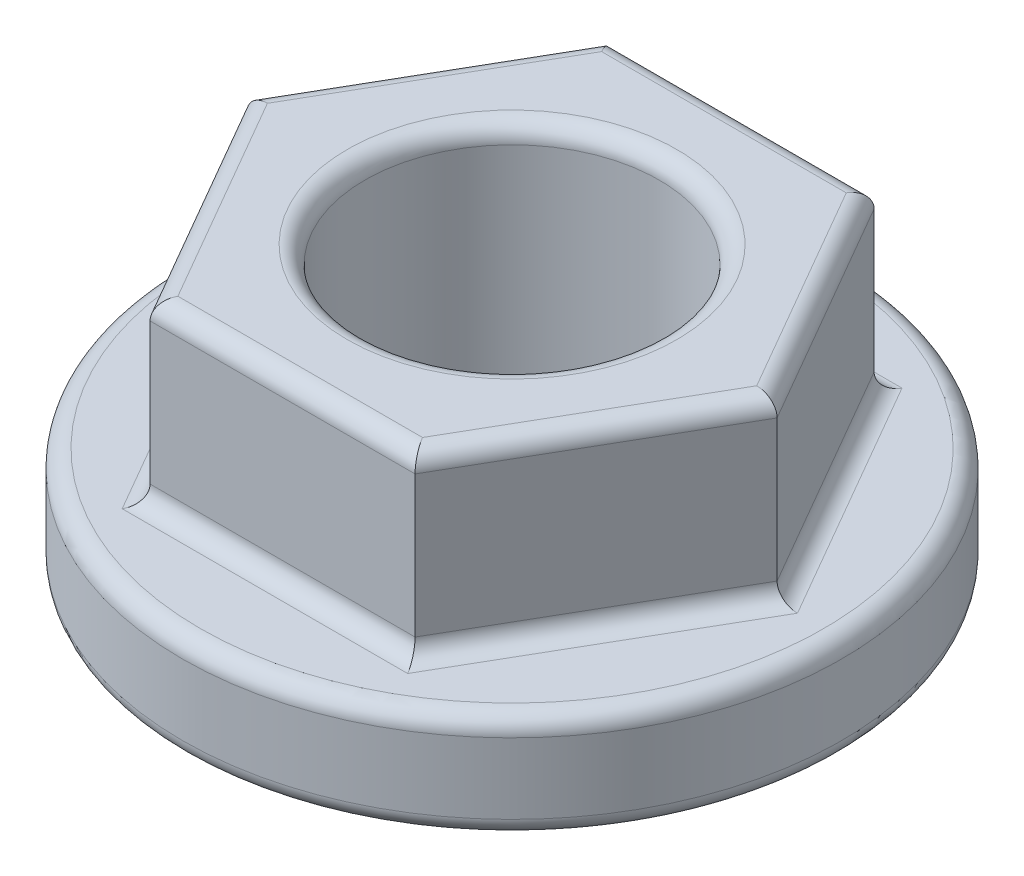
ISO-10303-21;
HEADER;
FILE_DESCRIPTION(('STEP AP214'),'2;1');
FILE_NAME('part.step','',(''),(''),'','','');
FILE_SCHEMA(('AUTOMOTIVE_DESIGN { 1 0 10303 214 1 1 1 1 }'));
ENDSEC;
DATA;
#1=APPLICATION_CONTEXT('core data for automotive mechanical design processes');
#2=APPLICATION_PROTOCOL_DEFINITION('international standard','automotive_design',2000,#1);
#3=PRODUCT_CONTEXT('',#1,'mechanical');
#4=PRODUCT('Part','Part','',(#3));
#5=PRODUCT_RELATED_PRODUCT_CATEGORY('part','',(#4));
#6=PRODUCT_DEFINITION_FORMATION('','',#4);
#7=PRODUCT_DEFINITION_CONTEXT('part definition',#1,'design');
#8=PRODUCT_DEFINITION('design','',#6,#7);
#9=PRODUCT_DEFINITION_SHAPE('','',#8);
#10=(LENGTH_UNIT() NAMED_UNIT(*) SI_UNIT(.MILLI.,.METRE.));
#11=(NAMED_UNIT(*) PLANE_ANGLE_UNIT() SI_UNIT($,.RADIAN.));
#12=(NAMED_UNIT(*) SI_UNIT($,.STERADIAN.) SOLID_ANGLE_UNIT());
#13=UNCERTAINTY_MEASURE_WITH_UNIT(LENGTH_MEASURE(1.E-05),#10,'distance_accuracy_value','');
#14=(GEOMETRIC_REPRESENTATION_CONTEXT(3) GLOBAL_UNCERTAINTY_ASSIGNED_CONTEXT((#13)) GLOBAL_UNIT_ASSIGNED_CONTEXT((#10,
#11,#12)) REPRESENTATION_CONTEXT('',''));
#15=CARTESIAN_POINT('',(0.,0.,0.));
#16=DIRECTION('',(0.,0.,1.));
#17=DIRECTION('',(1.,0.,0.));
#18=AXIS2_PLACEMENT_3D('',#15,#16,#17);
#19=CARTESIAN_POINT('',(0.,4.8,0.));
#20=DIRECTION('',(0.,-1.,0.));
#21=DIRECTION('',(0.,0.,-1.));
#22=AXIS2_PLACEMENT_3D('',#19,#20,#21);
#23=CYLINDRICAL_SURFACE('',#22,5.6);
#24=CARTESIAN_POINT('',(0.,0.3,0.));
#25=DIRECTION('',(0.,1.,0.));
#26=DIRECTION('',(0.,0.,1.));
#27=AXIS2_PLACEMENT_3D('',#24,#25,#26);
#28=CIRCLE('',#27,5.6);
#29=CARTESIAN_POINT('',(0.,0.3,5.6));
#30=VERTEX_POINT('',#29);
#31=EDGE_CURVE('E246',#30,#30,#28,.T.);
#32=ORIENTED_EDGE('',*,*,#31,.T.);
#33=EDGE_LOOP('',(#32));
#34=FACE_BOUND('',#33,.T.);
#35=CARTESIAN_POINT('',(0.,1.5,0.));
#36=DIRECTION('',(0.,1.,0.));
#37=DIRECTION('',(0.,0.,1.));
#38=AXIS2_PLACEMENT_3D('',#35,#36,#37);
#39=CIRCLE('',#38,5.6);
#40=CARTESIAN_POINT('',(0.,1.5,5.6));
#41=VERTEX_POINT('',#40);
#42=EDGE_CURVE('E243',#41,#41,#39,.F.);
#43=ORIENTED_EDGE('',*,*,#42,.T.);
#44=EDGE_LOOP('',(#43));
#45=FACE_BOUND('',#44,.T.);
#46=ADVANCED_FACE('F33',(#34,#45),#23,.T.);
#47=CARTESIAN_POINT('',(0.,4.8,0.));
#48=DIRECTION('',(0.,1.,0.));
#49=DIRECTION('',(0.,0.,1.));
#50=AXIS2_PLACEMENT_3D('',#47,#48,#49);
#51=PLANE('',#50);
#52=DIRECTION('',(-0.5,0.,0.866025403784439));
#53=VECTOR('',#52,1.);
#54=CARTESIAN_POINT('',(-3.11769145362398,4.8,-1.8));
#55=LINE('',#54,#53);
#56=CARTESIAN_POINT('',(-2.07846096908265,4.8,-3.6));
#57=VERTEX_POINT('',#56);
#58=CARTESIAN_POINT('',(-4.15692193816531,4.8,0.));
#59=VERTEX_POINT('',#58);
#60=EDGE_CURVE('E42',#57,#59,#55,.T.);
#61=ORIENTED_EDGE('',*,*,#60,.T.);
#62=DIRECTION('',(0.5,0.,0.866025403784439));
#63=VECTOR('',#62,1.);
#64=CARTESIAN_POINT('',(-3.11769145362398,4.8,1.8));
#65=LINE('',#64,#63);
#66=CARTESIAN_POINT('',(-2.07846096908265,4.8,3.6));
#67=VERTEX_POINT('',#66);
#68=EDGE_CURVE('E12',#59,#67,#65,.T.);
#69=ORIENTED_EDGE('',*,*,#68,.T.);
#70=DIRECTION('',(1.,0.,0.));
#71=VECTOR('',#70,1.);
#72=CARTESIAN_POINT('',(0.,4.8,3.6));
#73=LINE('',#72,#71);
#74=CARTESIAN_POINT('',(2.07846096908265,4.8,3.6));
#75=VERTEX_POINT('',#74);
#76=EDGE_CURVE('E184',#67,#75,#73,.T.);
#77=ORIENTED_EDGE('',*,*,#76,.T.);
#78=DIRECTION('',(0.5,0.,-0.866025403784439));
#79=VECTOR('',#78,1.);
#80=CARTESIAN_POINT('',(3.11769145362398,4.8,1.8));
#81=LINE('',#80,#79);
#82=CARTESIAN_POINT('',(4.1569219381653,4.8,0.));
#83=VERTEX_POINT('',#82);
#84=EDGE_CURVE('E186',#75,#83,#81,.T.);
#85=ORIENTED_EDGE('',*,*,#84,.T.);
#86=DIRECTION('',(-0.5,0.,-0.866025403784438));
#87=VECTOR('',#86,1.);
#88=CARTESIAN_POINT('',(3.11769145362398,4.8,-1.8));
#89=LINE('',#88,#87);
#90=CARTESIAN_POINT('',(2.07846096908265,4.8,-3.6));
#91=VERTEX_POINT('',#90);
#92=EDGE_CURVE('E188',#83,#91,#89,.T.);
#93=ORIENTED_EDGE('',*,*,#92,.T.);
#94=DIRECTION('',(-1.,0.,0.));
#95=VECTOR('',#94,1.);
#96=CARTESIAN_POINT('',(0.,4.8,-3.6));
#97=LINE('',#96,#95);
#98=EDGE_CURVE('E53',#91,#57,#97,.T.);
#99=ORIENTED_EDGE('',*,*,#98,.T.);
#100=EDGE_LOOP('',(#61,#69,#77,#85,#93,#99));
#101=FACE_BOUND('',#100,.T.);
#102=CARTESIAN_POINT('',(0.,4.8,0.));
#103=DIRECTION('',(0.,1.,0.));
#104=DIRECTION('',(0.,0.,1.));
#105=AXIS2_PLACEMENT_3D('',#102,#103,#104);
#106=CIRCLE('',#105,2.8);
#107=CARTESIAN_POINT('',(0.,4.8,2.8));
#108=VERTEX_POINT('',#107);
#109=EDGE_CURVE('E181',#108,#108,#106,.F.);
#110=ORIENTED_EDGE('',*,*,#109,.T.);
#111=EDGE_LOOP('',(#110));
#112=FACE_BOUND('',#111,.T.);
#113=ADVANCED_FACE('F321',(#101,#112),#51,.T.);
#114=CARTESIAN_POINT('',(0.,0.,0.));
#115=DIRECTION('',(0.,1.,0.));
#116=DIRECTION('',(0.,0.,1.));
#117=AXIS2_PLACEMENT_3D('',#114,#115,#116);
#118=PLANE('',#117);
#119=CARTESIAN_POINT('',(0.,0.,0.));
#120=DIRECTION('',(0.,1.,0.));
#121=DIRECTION('',(0.,0.,1.));
#122=AXIS2_PLACEMENT_3D('',#119,#120,#121);
#123=CIRCLE('',#122,5.3);
#124=CARTESIAN_POINT('',(0.,0.,5.3));
#125=VERTEX_POINT('',#124);
#126=EDGE_CURVE('E253',#125,#125,#123,.F.);
#127=ORIENTED_EDGE('',*,*,#126,.T.);
#128=EDGE_LOOP('',(#127));
#129=FACE_BOUND('',#128,.T.);
#130=CARTESIAN_POINT('',(0.,0.,0.));
#131=DIRECTION('',(0.,1.,0.));
#132=DIRECTION('',(0.,0.,1.));
#133=AXIS2_PLACEMENT_3D('',#130,#131,#132);
#134=CIRCLE('',#133,2.8);
#135=CARTESIAN_POINT('',(0.,0.,2.8));
#136=VERTEX_POINT('',#135);
#137=EDGE_CURVE('E250',#136,#136,#134,.T.);
#138=ORIENTED_EDGE('',*,*,#137,.T.);
#139=EDGE_LOOP('',(#138));
#140=FACE_BOUND('',#139,.T.);
#141=ADVANCED_FACE('F327',(#129,#140),#118,.F.);
#142=CARTESIAN_POINT('',(0.,0.,0.));
#143=DIRECTION('',(0.,1.,0.));
#144=DIRECTION('',(0.,0.,1.));
#145=AXIS2_PLACEMENT_3D('',#142,#143,#144);
#146=CYLINDRICAL_SURFACE('',#145,2.5);
#147=CARTESIAN_POINT('',(0.,0.3,0.));
#148=DIRECTION('',(0.,1.,0.));
#149=DIRECTION('',(0.,0.,1.));
#150=AXIS2_PLACEMENT_3D('',#147,#148,#149);
#151=CIRCLE('',#150,2.5);
#152=CARTESIAN_POINT('',(0.,0.3,2.5));
#153=VERTEX_POINT('',#152);
#154=EDGE_CURVE('E144',#153,#153,#151,.F.);
#155=ORIENTED_EDGE('',*,*,#154,.T.);
#156=EDGE_LOOP('',(#155));
#157=FACE_BOUND('',#156,.T.);
#158=CARTESIAN_POINT('',(0.,4.5,0.));
#159=DIRECTION('',(0.,1.,0.));
#160=DIRECTION('',(0.,0.,1.));
#161=AXIS2_PLACEMENT_3D('',#158,#159,#160);
#162=CIRCLE('',#161,2.5);
#163=CARTESIAN_POINT('',(0.,4.5,2.5));
#164=VERTEX_POINT('',#163);
#165=EDGE_CURVE('E256',#164,#164,#162,.T.);
#166=ORIENTED_EDGE('',*,*,#165,.T.);
#167=EDGE_LOOP('',(#166));
#168=FACE_BOUND('',#167,.T.);
#169=ADVANCED_FACE('F501',(#157,#168),#146,.F.);
#170=CARTESIAN_POINT('',(0.,1.8,0.));
#171=DIRECTION('',(0.,1.,0.));
#172=DIRECTION('',(0.,0.,1.));
#173=AXIS2_PLACEMENT_3D('',#170,#171,#172);
#174=PLANE('',#173);
#175=CARTESIAN_POINT('',(0.,1.8,0.));
#176=DIRECTION('',(0.,1.,0.));
#177=DIRECTION('',(0.,0.,1.));
#178=AXIS2_PLACEMENT_3D('',#175,#176,#177);
#179=CIRCLE('',#178,5.3);
#180=CARTESIAN_POINT('',(0.,1.8,5.3));
#181=VERTEX_POINT('',#180);
#182=EDGE_CURVE('E149',#181,#181,#179,.T.);
#183=ORIENTED_EDGE('',*,*,#182,.T.);
#184=EDGE_LOOP('',(#183));
#185=FACE_BOUND('',#184,.T.);
#186=DIRECTION('',(-0.5,0.,-0.866025403784438));
#187=VECTOR('',#186,1.);
#188=CARTESIAN_POINT('',(4.76313972081441,1.8,-0.150000000000001));
#189=LINE('',#188,#187);
#190=CARTESIAN_POINT('',(2.42487113059643,1.8,-4.2));
#191=VERTEX_POINT('',#190);
#192=CARTESIAN_POINT('',(4.84974226119286,1.8,0.));
#193=VERTEX_POINT('',#192);
#194=EDGE_CURVE('E148',#191,#193,#189,.F.);
#195=ORIENTED_EDGE('',*,*,#194,.T.);
#196=DIRECTION('',(0.5,0.,-0.866025403784439));
#197=VECTOR('',#196,1.);
#198=CARTESIAN_POINT('',(2.51147367097487,1.8,4.05));
#199=LINE('',#198,#197);
#200=CARTESIAN_POINT('',(2.42487113059643,1.8,4.2));
#201=VERTEX_POINT('',#200);
#202=EDGE_CURVE('E127',#193,#201,#199,.F.);
#203=ORIENTED_EDGE('',*,*,#202,.T.);
#204=DIRECTION('',(1.,0.,0.));
#205=VECTOR('',#204,1.);
#206=CARTESIAN_POINT('',(-2.25166604983954,1.8,4.2));
#207=LINE('',#206,#205);
#208=CARTESIAN_POINT('',(-2.42487113059643,1.8,4.2));
#209=VERTEX_POINT('',#208);
#210=EDGE_CURVE('E137',#201,#209,#207,.F.);
#211=ORIENTED_EDGE('',*,*,#210,.T.);
#212=DIRECTION('',(0.5,0.,0.866025403784439));
#213=VECTOR('',#212,1.);
#214=CARTESIAN_POINT('',(-4.76313972081441,1.8,0.15));
#215=LINE('',#214,#213);
#216=CARTESIAN_POINT('',(-4.84974226119286,1.8,0.));
#217=VERTEX_POINT('',#216);
#218=EDGE_CURVE('E143',#209,#217,#215,.F.);
#219=ORIENTED_EDGE('',*,*,#218,.T.);
#220=DIRECTION('',(-0.5,0.,0.866025403784439));
#221=VECTOR('',#220,1.);
#222=CARTESIAN_POINT('',(-2.51147367097487,1.8,-4.05));
#223=LINE('',#222,#221);
#224=CARTESIAN_POINT('',(-2.42487113059643,1.8,-4.2));
#225=VERTEX_POINT('',#224);
#226=EDGE_CURVE('E262',#217,#225,#223,.F.);
#227=ORIENTED_EDGE('',*,*,#226,.T.);
#228=DIRECTION('',(-1.,0.,0.));
#229=VECTOR('',#228,1.);
#230=CARTESIAN_POINT('',(2.25166604983954,1.8,-4.2));
#231=LINE('',#230,#229);
#232=EDGE_CURVE('E154',#225,#191,#231,.F.);
#233=ORIENTED_EDGE('',*,*,#232,.T.);
#234=EDGE_LOOP('',(#195,#203,#211,#219,#227,#233));
#235=FACE_BOUND('',#234,.T.);
#236=ADVANCED_FACE('F146',(#185,#235),#174,.T.);
#237=CARTESIAN_POINT('',(2.25166604983954,1.8,3.9));
#238=DIRECTION('',(0.866025403784439,0.,0.5));
#239=DIRECTION('',(0.5,0.,-0.866025403784439));
#240=AXIS2_PLACEMENT_3D('',#237,#238,#239);
#241=PLANE('',#240);
#242=DIRECTION('',(0.,1.,0.));
#243=VECTOR('',#242,1.);
#244=CARTESIAN_POINT('',(2.25166604983954,1.8,3.9));
#245=LINE('',#244,#243);
#246=CARTESIAN_POINT('',(2.25166604983954,2.1,3.9));
#247=VERTEX_POINT('',#246);
#248=CARTESIAN_POINT('',(2.25166604983954,4.5,3.9));
#249=VERTEX_POINT('',#248);
#250=EDGE_CURVE('E247',#247,#249,#245,.T.);
#251=ORIENTED_EDGE('',*,*,#250,.F.);
#252=DIRECTION('',(0.5,0.,-0.866025403784439));
#253=VECTOR('',#252,1.);
#254=CARTESIAN_POINT('',(4.50333209967908,2.1,0.));
#255=LINE('',#254,#253);
#256=CARTESIAN_POINT('',(4.50333209967908,2.1,0.));
#257=VERTEX_POINT('',#256);
#258=EDGE_CURVE('E130',#247,#257,#255,.T.);
#259=ORIENTED_EDGE('',*,*,#258,.T.);
#260=DIRECTION('',(0.,1.,0.));
#261=VECTOR('',#260,1.);
#262=CARTESIAN_POINT('',(4.50333209967908,1.8,0.));
#263=LINE('',#262,#261);
#264=CARTESIAN_POINT('',(4.50333209967908,4.5,0.));
#265=VERTEX_POINT('',#264);
#266=EDGE_CURVE('E202',#257,#265,#263,.T.);
#267=ORIENTED_EDGE('',*,*,#266,.T.);
#268=DIRECTION('',(0.5,0.,-0.866025403784439));
#269=VECTOR('',#268,1.);
#270=CARTESIAN_POINT('',(2.25166604983954,4.5,3.9));
#271=LINE('',#270,#269);
#272=EDGE_CURVE('E152',#265,#249,#271,.F.);
#273=ORIENTED_EDGE('',*,*,#272,.T.);
#274=EDGE_LOOP('',(#251,#259,#267,#273));
#275=FACE_BOUND('',#274,.T.);
#276=ADVANCED_FACE('F236',(#275),#241,.T.);
#277=CARTESIAN_POINT('',(-2.25166604983954,1.8,3.9));
#278=DIRECTION('',(0.,0.,1.));
#279=DIRECTION('',(1.,0.,0.));
#280=AXIS2_PLACEMENT_3D('',#277,#278,#279);
#281=PLANE('',#280);
#282=DIRECTION('',(0.,1.,0.));
#283=VECTOR('',#282,1.);
#284=CARTESIAN_POINT('',(-2.25166604983954,1.8,3.9));
#285=LINE('',#284,#283);
#286=CARTESIAN_POINT('',(-2.25166604983954,2.1,3.9));
#287=VERTEX_POINT('',#286);
#288=CARTESIAN_POINT('',(-2.25166604983954,4.5,3.9));
#289=VERTEX_POINT('',#288);
#290=EDGE_CURVE('E281',#287,#289,#285,.T.);
#291=ORIENTED_EDGE('',*,*,#290,.F.);
#292=DIRECTION('',(1.,0.,0.));
#293=VECTOR('',#292,1.);
#294=CARTESIAN_POINT('',(2.25166604983954,2.1,3.9));
#295=LINE('',#294,#293);
#296=EDGE_CURVE('E179',#287,#247,#295,.T.);
#297=ORIENTED_EDGE('',*,*,#296,.T.);
#298=ORIENTED_EDGE('',*,*,#250,.T.);
#299=DIRECTION('',(1.,0.,0.));
#300=VECTOR('',#299,1.);
#301=CARTESIAN_POINT('',(-2.25166604983954,4.5,3.9));
#302=LINE('',#301,#300);
#303=EDGE_CURVE('E177',#249,#289,#302,.F.);
#304=ORIENTED_EDGE('',*,*,#303,.T.);
#305=EDGE_LOOP('',(#291,#297,#298,#304));
#306=FACE_BOUND('',#305,.T.);
#307=ADVANCED_FACE('F289',(#306),#281,.T.);
#308=CARTESIAN_POINT('',(-4.50333209967908,1.8,0.));
#309=DIRECTION('',(-0.866025403784438,0.,0.5));
#310=DIRECTION('',(0.5,0.,0.866025403784439));
#311=AXIS2_PLACEMENT_3D('',#308,#309,#310);
#312=PLANE('',#311);
#313=DIRECTION('',(0.,1.,0.));
#314=VECTOR('',#313,1.);
#315=CARTESIAN_POINT('',(-4.50333209967908,1.8,0.));
#316=LINE('',#315,#314);
#317=CARTESIAN_POINT('',(-4.50333209967908,2.1,0.));
#318=VERTEX_POINT('',#317);
#319=CARTESIAN_POINT('',(-4.50333209967908,4.5,0.));
#320=VERTEX_POINT('',#319);
#321=EDGE_CURVE('E279',#318,#320,#316,.T.);
#322=ORIENTED_EDGE('',*,*,#321,.F.);
#323=DIRECTION('',(0.5,0.,0.866025403784439));
#324=VECTOR('',#323,1.);
#325=CARTESIAN_POINT('',(-2.25166604983954,2.1,3.9));
#326=LINE('',#325,#324);
#327=EDGE_CURVE('E175',#318,#287,#326,.T.);
#328=ORIENTED_EDGE('',*,*,#327,.T.);
#329=ORIENTED_EDGE('',*,*,#290,.T.);
#330=DIRECTION('',(0.5,0.,0.866025403784439));
#331=VECTOR('',#330,1.);
#332=CARTESIAN_POINT('',(-4.50333209967908,4.5,0.));
#333=LINE('',#332,#331);
#334=EDGE_CURVE('E172',#289,#320,#333,.F.);
#335=ORIENTED_EDGE('',*,*,#334,.T.);
#336=EDGE_LOOP('',(#322,#328,#329,#335));
#337=FACE_BOUND('',#336,.T.);
#338=ADVANCED_FACE('F303',(#337),#312,.T.);
#339=CARTESIAN_POINT('',(-2.25166604983954,1.8,-3.9));
#340=DIRECTION('',(-0.866025403784438,0.,-0.5));
#341=DIRECTION('',(-0.5,0.,0.866025403784439));
#342=AXIS2_PLACEMENT_3D('',#339,#340,#341);
#343=PLANE('',#342);
#344=DIRECTION('',(0.,1.,0.));
#345=VECTOR('',#344,1.);
#346=CARTESIAN_POINT('',(-2.25166604983954,1.8,-3.9));
#347=LINE('',#346,#345);
#348=CARTESIAN_POINT('',(-2.25166604983954,2.1,-3.9));
#349=VERTEX_POINT('',#348);
#350=CARTESIAN_POINT('',(-2.25166604983954,4.5,-3.9));
#351=VERTEX_POINT('',#350);
#352=EDGE_CURVE('E239',#349,#351,#347,.T.);
#353=ORIENTED_EDGE('',*,*,#352,.F.);
#354=DIRECTION('',(-0.5,0.,0.866025403784439));
#355=VECTOR('',#354,1.);
#356=CARTESIAN_POINT('',(-4.50333209967908,2.1,0.));
#357=LINE('',#356,#355);
#358=EDGE_CURVE('E170',#349,#318,#357,.T.);
#359=ORIENTED_EDGE('',*,*,#358,.T.);
#360=ORIENTED_EDGE('',*,*,#321,.T.);
#361=DIRECTION('',(-0.5,0.,0.866025403784439));
#362=VECTOR('',#361,1.);
#363=CARTESIAN_POINT('',(-2.25166604983954,4.5,-3.9));
#364=LINE('',#363,#362);
#365=EDGE_CURVE('E168',#320,#351,#364,.F.);
#366=ORIENTED_EDGE('',*,*,#365,.T.);
#367=EDGE_LOOP('',(#353,#359,#360,#366));
#368=FACE_BOUND('',#367,.T.);
#369=ADVANCED_FACE('F305',(#368),#343,.T.);
#370=CARTESIAN_POINT('',(2.25166604983954,1.8,-3.9));
#371=DIRECTION('',(0.,0.,-1.));
#372=DIRECTION('',(-1.,0.,0.));
#373=AXIS2_PLACEMENT_3D('',#370,#371,#372);
#374=PLANE('',#373);
#375=DIRECTION('',(0.,1.,0.));
#376=VECTOR('',#375,1.);
#377=CARTESIAN_POINT('',(2.25166604983954,1.8,-3.9));
#378=LINE('',#377,#376);
#379=CARTESIAN_POINT('',(2.25166604983954,2.1,-3.9));
#380=VERTEX_POINT('',#379);
#381=CARTESIAN_POINT('',(2.25166604983954,4.5,-3.9));
#382=VERTEX_POINT('',#381);
#383=EDGE_CURVE('E233',#380,#382,#378,.T.);
#384=ORIENTED_EDGE('',*,*,#383,.F.);
#385=DIRECTION('',(-1.,0.,0.));
#386=VECTOR('',#385,1.);
#387=CARTESIAN_POINT('',(-2.25166604983954,2.1,-3.9));
#388=LINE('',#387,#386);
#389=EDGE_CURVE('E166',#380,#349,#388,.T.);
#390=ORIENTED_EDGE('',*,*,#389,.T.);
#391=ORIENTED_EDGE('',*,*,#352,.T.);
#392=DIRECTION('',(-1.,0.,0.));
#393=VECTOR('',#392,1.);
#394=CARTESIAN_POINT('',(2.25166604983954,4.5,-3.9));
#395=LINE('',#394,#393);
#396=EDGE_CURVE('E164',#351,#382,#395,.F.);
#397=ORIENTED_EDGE('',*,*,#396,.T.);
#398=EDGE_LOOP('',(#384,#390,#391,#397));
#399=FACE_BOUND('',#398,.T.);
#400=ADVANCED_FACE('F274',(#399),#374,.T.);
#401=CARTESIAN_POINT('',(4.50333209967908,1.8,0.));
#402=DIRECTION('',(0.866025403784438,0.,-0.5));
#403=DIRECTION('',(-0.5,0.,-0.866025403784438));
#404=AXIS2_PLACEMENT_3D('',#401,#402,#403);
#405=PLANE('',#404);
#406=ORIENTED_EDGE('',*,*,#266,.F.);
#407=DIRECTION('',(-0.5,0.,-0.866025403784438));
#408=VECTOR('',#407,1.);
#409=CARTESIAN_POINT('',(2.25166604983954,2.1,-3.9));
#410=LINE('',#409,#408);
#411=EDGE_CURVE('E162',#257,#380,#410,.T.);
#412=ORIENTED_EDGE('',*,*,#411,.T.);
#413=ORIENTED_EDGE('',*,*,#383,.T.);
#414=DIRECTION('',(-0.5,0.,-0.866025403784438));
#415=VECTOR('',#414,1.);
#416=CARTESIAN_POINT('',(4.50333209967908,4.5,0.));
#417=LINE('',#416,#415);
#418=EDGE_CURVE('E160',#382,#265,#417,.F.);
#419=ORIENTED_EDGE('',*,*,#418,.T.);
#420=EDGE_LOOP('',(#406,#412,#413,#419));
#421=FACE_BOUND('',#420,.T.);
#422=ADVANCED_FACE('F231',(#421),#405,.T.);
#423=CARTESIAN_POINT('',(0.,0.3,0.));
#424=DIRECTION('',(0.,1.,0.));
#425=DIRECTION('',(0.,0.,1.));
#426=AXIS2_PLACEMENT_3D('',#423,#424,#425);
#427=TOROIDAL_SURFACE('',#426,5.3,0.3);
#428=ORIENTED_EDGE('',*,*,#126,.F.);
#429=EDGE_LOOP('',(#428));
#430=FACE_BOUND('',#429,.T.);
#431=ORIENTED_EDGE('',*,*,#31,.F.);
#432=EDGE_LOOP('',(#431));
#433=FACE_BOUND('',#432,.T.);
#434=ADVANCED_FACE('F332',(#430,#433),#427,.T.);
#435=CARTESIAN_POINT('',(0.,0.3,0.));
#436=DIRECTION('',(0.,1.,0.));
#437=DIRECTION('',(0.,0.,1.));
#438=AXIS2_PLACEMENT_3D('',#435,#436,#437);
#439=TOROIDAL_SURFACE('',#438,2.8,0.3);
#440=ORIENTED_EDGE('',*,*,#154,.F.);
#441=EDGE_LOOP('',(#440));
#442=FACE_BOUND('',#441,.T.);
#443=ORIENTED_EDGE('',*,*,#137,.F.);
#444=EDGE_LOOP('',(#443));
#445=FACE_BOUND('',#444,.T.);
#446=ADVANCED_FACE('F335',(#442,#445),#439,.T.);
#447=CARTESIAN_POINT('',(0.,1.5,0.));
#448=DIRECTION('',(0.,1.,0.));
#449=DIRECTION('',(0.,0.,1.));
#450=AXIS2_PLACEMENT_3D('',#447,#448,#449);
#451=TOROIDAL_SURFACE('',#450,5.3,0.3);
#452=ORIENTED_EDGE('',*,*,#42,.F.);
#453=EDGE_LOOP('',(#452));
#454=FACE_BOUND('',#453,.T.);
#455=ORIENTED_EDGE('',*,*,#182,.F.);
#456=EDGE_LOOP('',(#455));
#457=FACE_BOUND('',#456,.T.);
#458=ADVANCED_FACE('F318',(#454,#457),#451,.T.);
#459=CARTESIAN_POINT('',(-2.51147367097487,2.1,-4.05));
#460=DIRECTION('',(0.5,0.,-0.866025403784439));
#461=DIRECTION('',(-0.866025403784439,0.,-0.5));
#462=AXIS2_PLACEMENT_3D('',#459,#460,#461);
#463=CYLINDRICAL_SURFACE('',#462,0.3);
#464=CARTESIAN_POINT('',(-2.42487113059643,2.1,-4.2));
#465=DIRECTION('',(0.866025403784439,0.,-0.5));
#466=DIRECTION('',(-0.5,0.,-0.866025403784439));
#467=AXIS2_PLACEMENT_3D('',#464,#465,#466);
#468=ELLIPSE('',#467,0.346410161513775,0.3);
#469=EDGE_CURVE('E196',#225,#349,#468,.F.);
#470=ORIENTED_EDGE('',*,*,#469,.F.);
#471=ORIENTED_EDGE('',*,*,#226,.F.);
#472=CARTESIAN_POINT('',(-4.84974226119286,2.1,0.));
#473=DIRECTION('',(0.,0.,-1.));
#474=DIRECTION('',(-1.,0.,0.));
#475=AXIS2_PLACEMENT_3D('',#472,#473,#474);
#476=ELLIPSE('',#475,0.346410161513776,0.3);
#477=EDGE_CURVE('E199',#318,#217,#476,.T.);
#478=ORIENTED_EDGE('',*,*,#477,.F.);
#479=ORIENTED_EDGE('',*,*,#358,.F.);
#480=EDGE_LOOP('',(#470,#471,#478,#479));
#481=FACE_BOUND('',#480,.T.);
#482=ADVANCED_FACE('F307',(#481),#463,.F.);
#483=CARTESIAN_POINT('',(-4.76313972081441,2.1,0.15));
#484=DIRECTION('',(-0.5,0.,-0.866025403784439));
#485=DIRECTION('',(-0.866025403784439,0.,0.5));
#486=AXIS2_PLACEMENT_3D('',#483,#484,#485);
#487=CYLINDRICAL_SURFACE('',#486,0.3);
#488=ORIENTED_EDGE('',*,*,#477,.T.);
#489=ORIENTED_EDGE('',*,*,#218,.F.);
#490=CARTESIAN_POINT('',(-2.42487113059643,2.1,4.2));
#491=DIRECTION('',(-0.866025403784439,0.,-0.5));
#492=DIRECTION('',(-0.5,0.,0.866025403784439));
#493=AXIS2_PLACEMENT_3D('',#490,#491,#492);
#494=ELLIPSE('',#493,0.346410161513775,0.3);
#495=EDGE_CURVE('E140',#287,#209,#494,.T.);
#496=ORIENTED_EDGE('',*,*,#495,.F.);
#497=ORIENTED_EDGE('',*,*,#327,.F.);
#498=EDGE_LOOP('',(#488,#489,#496,#497));
#499=FACE_BOUND('',#498,.T.);
#500=ADVANCED_FACE('F310',(#499),#487,.F.);
#501=CARTESIAN_POINT('',(2.25166604983954,2.1,-4.2));
#502=DIRECTION('',(1.,0.,0.));
#503=DIRECTION('',(0.,0.,-1.));
#504=AXIS2_PLACEMENT_3D('',#501,#502,#503);
#505=CYLINDRICAL_SURFACE('',#504,0.3);
#506=ORIENTED_EDGE('',*,*,#469,.T.);
#507=ORIENTED_EDGE('',*,*,#389,.F.);
#508=CARTESIAN_POINT('',(2.42487113059643,2.1,-4.2));
#509=DIRECTION('',(0.866025403784439,0.,0.5));
#510=DIRECTION('',(0.5,0.,-0.866025403784439));
#511=AXIS2_PLACEMENT_3D('',#508,#509,#510);
#512=ELLIPSE('',#511,0.346410161513775,0.3);
#513=EDGE_CURVE('E133',#191,#380,#512,.F.);
#514=ORIENTED_EDGE('',*,*,#513,.F.);
#515=ORIENTED_EDGE('',*,*,#232,.F.);
#516=EDGE_LOOP('',(#506,#507,#514,#515));
#517=FACE_BOUND('',#516,.T.);
#518=ADVANCED_FACE('F269',(#517),#505,.F.);
#519=CARTESIAN_POINT('',(-2.25166604983954,2.1,4.2));
#520=DIRECTION('',(-1.,0.,0.));
#521=DIRECTION('',(0.,0.,1.));
#522=AXIS2_PLACEMENT_3D('',#519,#520,#521);
#523=CYLINDRICAL_SURFACE('',#522,0.3);
#524=ORIENTED_EDGE('',*,*,#495,.T.);
#525=ORIENTED_EDGE('',*,*,#210,.F.);
#526=CARTESIAN_POINT('',(2.42487113059643,2.1,4.2));
#527=DIRECTION('',(-0.866025403784438,0.,0.5));
#528=DIRECTION('',(-0.5,0.,-0.866025403784439));
#529=AXIS2_PLACEMENT_3D('',#526,#527,#528);
#530=ELLIPSE('',#529,0.346410161513775,0.3);
#531=EDGE_CURVE('E123',#247,#201,#530,.T.);
#532=ORIENTED_EDGE('',*,*,#531,.F.);
#533=ORIENTED_EDGE('',*,*,#296,.F.);
#534=EDGE_LOOP('',(#524,#525,#532,#533));
#535=FACE_BOUND('',#534,.T.);
#536=ADVANCED_FACE('F138',(#535),#523,.F.);
#537=CARTESIAN_POINT('',(4.76313972081441,2.1,-0.150000000000001));
#538=DIRECTION('',(0.5,0.,0.866025403784438));
#539=DIRECTION('',(0.866025403784438,0.,-0.5));
#540=AXIS2_PLACEMENT_3D('',#537,#538,#539);
#541=CYLINDRICAL_SURFACE('',#540,0.3);
#542=ORIENTED_EDGE('',*,*,#513,.T.);
#543=ORIENTED_EDGE('',*,*,#411,.F.);
#544=CARTESIAN_POINT('',(4.84974226119286,2.1,0.));
#545=DIRECTION('',(0.,0.,1.));
#546=DIRECTION('',(1.,0.,0.));
#547=AXIS2_PLACEMENT_3D('',#544,#545,#546);
#548=ELLIPSE('',#547,0.346410161513775,0.3);
#549=EDGE_CURVE('E134',#193,#257,#548,.F.);
#550=ORIENTED_EDGE('',*,*,#549,.F.);
#551=ORIENTED_EDGE('',*,*,#194,.F.);
#552=EDGE_LOOP('',(#542,#543,#550,#551));
#553=FACE_BOUND('',#552,.T.);
#554=ADVANCED_FACE('F272',(#553),#541,.F.);
#555=CARTESIAN_POINT('',(2.51147367097487,2.1,4.05));
#556=DIRECTION('',(-0.5,0.,0.866025403784439));
#557=DIRECTION('',(0.866025403784439,0.,0.5));
#558=AXIS2_PLACEMENT_3D('',#555,#556,#557);
#559=CYLINDRICAL_SURFACE('',#558,0.3);
#560=ORIENTED_EDGE('',*,*,#531,.T.);
#561=ORIENTED_EDGE('',*,*,#202,.F.);
#562=ORIENTED_EDGE('',*,*,#549,.T.);
#563=ORIENTED_EDGE('',*,*,#258,.F.);
#564=EDGE_LOOP('',(#560,#561,#562,#563));
#565=FACE_BOUND('',#564,.T.);
#566=ADVANCED_FACE('F125',(#565),#559,.F.);
#567=CARTESIAN_POINT('',(3.11769145362398,4.5,-1.8));
#568=DIRECTION('',(-0.5,0.,-0.866025403784438));
#569=DIRECTION('',(-0.866025403784438,0.,0.5));
#570=AXIS2_PLACEMENT_3D('',#567,#568,#569);
#571=CYLINDRICAL_SURFACE('',#570,0.3);
#572=CARTESIAN_POINT('',(4.15692193816531,4.5,0.));
#573=DIRECTION('',(0.,0.,-1.));
#574=DIRECTION('',(1.,0.,0.));
#575=AXIS2_PLACEMENT_3D('',#572,#573,#574);
#576=ELLIPSE('',#575,0.346410161513775,0.3);
#577=EDGE_CURVE('E212',#265,#83,#576,.F.);
#578=ORIENTED_EDGE('',*,*,#577,.F.);
#579=ORIENTED_EDGE('',*,*,#418,.F.);
#580=CARTESIAN_POINT('',(2.07846096908265,4.5,-3.6));
#581=DIRECTION('',(-0.866025403784439,0.,-0.5));
#582=DIRECTION('',(0.5,0.,-0.866025403784439));
#583=AXIS2_PLACEMENT_3D('',#580,#581,#582);
#584=ELLIPSE('',#583,0.346410161513775,0.3);
#585=EDGE_CURVE('E37',#91,#382,#584,.T.);
#586=ORIENTED_EDGE('',*,*,#585,.F.);
#587=ORIENTED_EDGE('',*,*,#92,.F.);
#588=EDGE_LOOP('',(#578,#579,#586,#587));
#589=FACE_BOUND('',#588,.T.);
#590=ADVANCED_FACE('F226',(#589),#571,.T.);
#591=CARTESIAN_POINT('',(0.,4.5,-3.6));
#592=DIRECTION('',(-1.,0.,0.));
#593=DIRECTION('',(0.,0.,1.));
#594=AXIS2_PLACEMENT_3D('',#591,#592,#593);
#595=CYLINDRICAL_SURFACE('',#594,0.3);
#596=ORIENTED_EDGE('',*,*,#585,.T.);
#597=ORIENTED_EDGE('',*,*,#396,.F.);
#598=CARTESIAN_POINT('',(-2.07846096908265,4.5,-3.6));
#599=DIRECTION('',(-0.866025403784439,0.,0.5));
#600=DIRECTION('',(-0.5,0.,-0.866025403784439));
#601=AXIS2_PLACEMENT_3D('',#598,#599,#600);
#602=ELLIPSE('',#601,0.346410161513775,0.3);
#603=EDGE_CURVE('E210',#57,#351,#602,.T.);
#604=ORIENTED_EDGE('',*,*,#603,.F.);
#605=ORIENTED_EDGE('',*,*,#98,.F.);
#606=EDGE_LOOP('',(#596,#597,#604,#605));
#607=FACE_BOUND('',#606,.T.);
#608=ADVANCED_FACE('F222',(#607),#595,.T.);
#609=CARTESIAN_POINT('',(3.11769145362398,4.5,1.8));
#610=DIRECTION('',(0.5,0.,-0.866025403784439));
#611=DIRECTION('',(-0.866025403784439,0.,-0.5));
#612=AXIS2_PLACEMENT_3D('',#609,#610,#611);
#613=CYLINDRICAL_SURFACE('',#612,0.3);
#614=ORIENTED_EDGE('',*,*,#577,.T.);
#615=ORIENTED_EDGE('',*,*,#84,.F.);
#616=CARTESIAN_POINT('',(2.07846096908265,4.5,3.6));
#617=DIRECTION('',(0.866025403784438,0.,-0.5));
#618=DIRECTION('',(0.5,0.,0.866025403784439));
#619=AXIS2_PLACEMENT_3D('',#616,#617,#618);
#620=ELLIPSE('',#619,0.346410161513775,0.3);
#621=EDGE_CURVE('E207',#249,#75,#620,.F.);
#622=ORIENTED_EDGE('',*,*,#621,.F.);
#623=ORIENTED_EDGE('',*,*,#272,.F.);
#624=EDGE_LOOP('',(#614,#615,#622,#623));
#625=FACE_BOUND('',#624,.T.);
#626=ADVANCED_FACE('F291',(#625),#613,.T.);
#627=CARTESIAN_POINT('',(-3.11769145362398,4.5,-1.8));
#628=DIRECTION('',(-0.5,0.,0.866025403784439));
#629=DIRECTION('',(0.866025403784439,0.,0.5));
#630=AXIS2_PLACEMENT_3D('',#627,#628,#629);
#631=CYLINDRICAL_SURFACE('',#630,0.3);
#632=ORIENTED_EDGE('',*,*,#603,.T.);
#633=ORIENTED_EDGE('',*,*,#365,.F.);
#634=CARTESIAN_POINT('',(-4.15692193816531,4.5,0.));
#635=DIRECTION('',(0.,0.,1.));
#636=DIRECTION('',(-1.,0.,0.));
#637=AXIS2_PLACEMENT_3D('',#634,#635,#636);
#638=ELLIPSE('',#637,0.346410161513776,0.3);
#639=EDGE_CURVE('E205',#59,#320,#638,.T.);
#640=ORIENTED_EDGE('',*,*,#639,.F.);
#641=ORIENTED_EDGE('',*,*,#60,.F.);
#642=EDGE_LOOP('',(#632,#633,#640,#641));
#643=FACE_BOUND('',#642,.T.);
#644=ADVANCED_FACE('F377',(#643),#631,.T.);
#645=CARTESIAN_POINT('',(0.,4.5,3.6));
#646=DIRECTION('',(1.,0.,0.));
#647=DIRECTION('',(0.,0.,-1.));
#648=AXIS2_PLACEMENT_3D('',#645,#646,#647);
#649=CYLINDRICAL_SURFACE('',#648,0.3);
#650=ORIENTED_EDGE('',*,*,#621,.T.);
#651=ORIENTED_EDGE('',*,*,#76,.F.);
#652=CARTESIAN_POINT('',(-2.07846096908265,4.5,3.6));
#653=DIRECTION('',(0.866025403784439,0.,0.5));
#654=DIRECTION('',(0.5,0.,-0.866025403784439));
#655=AXIS2_PLACEMENT_3D('',#652,#653,#654);
#656=ELLIPSE('',#655,0.346410161513775,0.3);
#657=EDGE_CURVE('E203',#289,#67,#656,.F.);
#658=ORIENTED_EDGE('',*,*,#657,.F.);
#659=ORIENTED_EDGE('',*,*,#303,.F.);
#660=EDGE_LOOP('',(#650,#651,#658,#659));
#661=FACE_BOUND('',#660,.T.);
#662=ADVANCED_FACE('F295',(#661),#649,.T.);
#663=CARTESIAN_POINT('',(-3.11769145362398,4.5,1.8));
#664=DIRECTION('',(0.5,0.,0.866025403784439));
#665=DIRECTION('',(0.866025403784439,0.,-0.5));
#666=AXIS2_PLACEMENT_3D('',#663,#664,#665);
#667=CYLINDRICAL_SURFACE('',#666,0.3);
#668=ORIENTED_EDGE('',*,*,#639,.T.);
#669=ORIENTED_EDGE('',*,*,#334,.F.);
#670=ORIENTED_EDGE('',*,*,#657,.T.);
#671=ORIENTED_EDGE('',*,*,#68,.F.);
#672=EDGE_LOOP('',(#668,#669,#670,#671));
#673=FACE_BOUND('',#672,.T.);
#674=ADVANCED_FACE('F299',(#673),#667,.T.);
#675=CARTESIAN_POINT('',(0.,4.5,0.));
#676=DIRECTION('',(0.,1.,0.));
#677=DIRECTION('',(0.,0.,1.));
#678=AXIS2_PLACEMENT_3D('',#675,#676,#677);
#679=TOROIDAL_SURFACE('',#678,2.8,0.3);
#680=ORIENTED_EDGE('',*,*,#109,.F.);
#681=EDGE_LOOP('',(#680));
#682=FACE_BOUND('',#681,.T.);
#683=ORIENTED_EDGE('',*,*,#165,.F.);
#684=EDGE_LOOP('',(#683));
#685=FACE_BOUND('',#684,.T.);
#686=ADVANCED_FACE('F35',(#682,#685),#679,.T.);
#687=CLOSED_SHELL('',(#46,#113,#141,#169,#236,#276,#307,#338,#369,#400,#422,#434,#446,#458,#482,
#500,#518,#536,#554,#566,#590,#608,#626,#644,#662,#674,#686));
#688=MANIFOLD_SOLID_BREP('B2',#687);
#689=ADVANCED_BREP_SHAPE_REPRESENTATION('',(#18,#688),#14);
#690=SHAPE_DEFINITION_REPRESENTATION(#9,#689);
ENDSEC;
END-ISO-10303-21;
